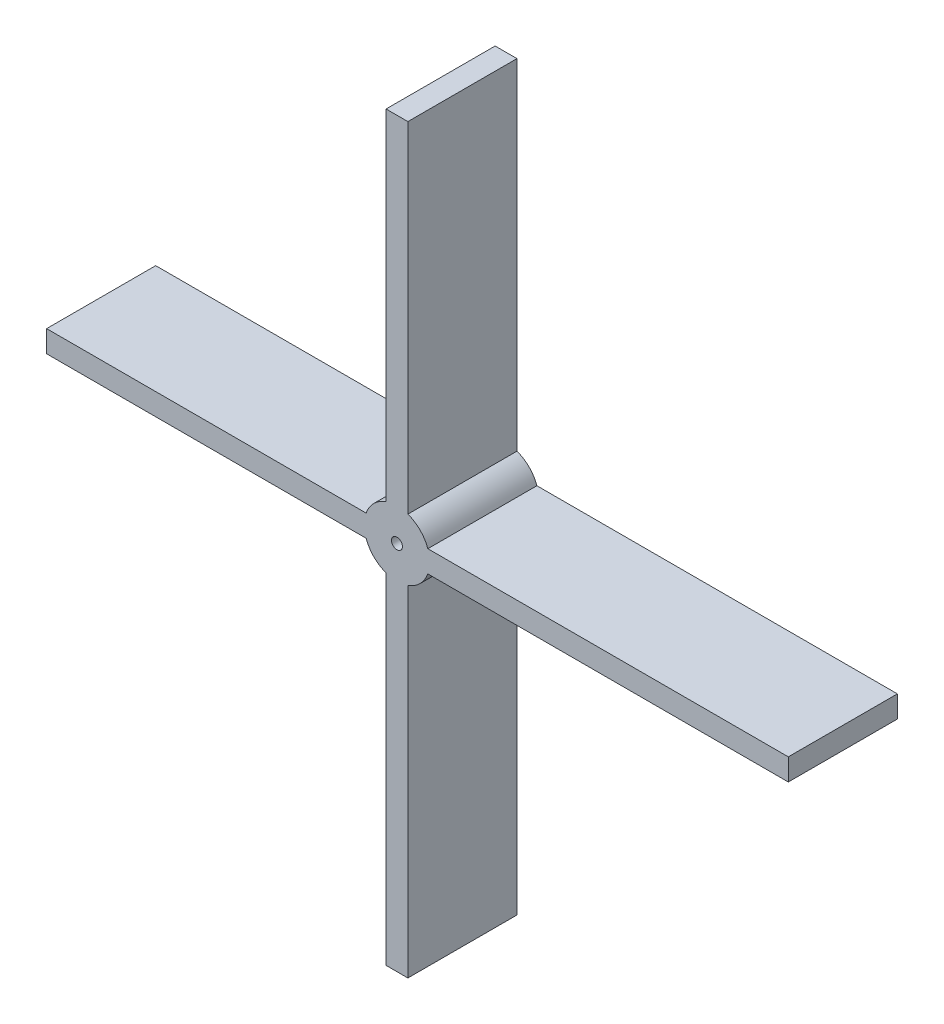
ISO-10303-21;
HEADER;
FILE_DESCRIPTION(('STEP AP214'),'2;1');
FILE_NAME('part.step','',(''),(''),'','','');
FILE_SCHEMA(('AUTOMOTIVE_DESIGN { 1 0 10303 214 1 1 1 1 }'));
ENDSEC;
DATA;
#1=APPLICATION_CONTEXT('core data for automotive mechanical design processes');
#2=APPLICATION_PROTOCOL_DEFINITION('international standard','automotive_design',2000,#1);
#3=PRODUCT_CONTEXT('',#1,'mechanical');
#4=PRODUCT('Part','Part','',(#3));
#5=PRODUCT_RELATED_PRODUCT_CATEGORY('part','',(#4));
#6=PRODUCT_DEFINITION_FORMATION('','',#4);
#7=PRODUCT_DEFINITION_CONTEXT('part definition',#1,'design');
#8=PRODUCT_DEFINITION('design','',#6,#7);
#9=PRODUCT_DEFINITION_SHAPE('','',#8);
#10=(LENGTH_UNIT() NAMED_UNIT(*) SI_UNIT(.MILLI.,.METRE.));
#11=(NAMED_UNIT(*) PLANE_ANGLE_UNIT() SI_UNIT($,.RADIAN.));
#12=(NAMED_UNIT(*) SI_UNIT($,.STERADIAN.) SOLID_ANGLE_UNIT());
#13=UNCERTAINTY_MEASURE_WITH_UNIT(LENGTH_MEASURE(1.E-05),#10,'distance_accuracy_value','');
#14=(GEOMETRIC_REPRESENTATION_CONTEXT(3) GLOBAL_UNCERTAINTY_ASSIGNED_CONTEXT((#13)) GLOBAL_UNIT_ASSIGNED_CONTEXT((#10,
#11,#12)) REPRESENTATION_CONTEXT('',''));
#15=CARTESIAN_POINT('',(0.,0.,0.));
#16=DIRECTION('',(0.,0.,1.));
#17=DIRECTION('',(1.,0.,0.));
#18=AXIS2_PLACEMENT_3D('',#15,#16,#17);
#19=CARTESIAN_POINT('',(5.,-5.,50.));
#20=DIRECTION('',(0.,1.,0.));
#21=DIRECTION('',(-1.,0.,0.));
#22=AXIS2_PLACEMENT_3D('',#19,#20,#21);
#23=PLANE('',#22);
#24=DIRECTION('',(1.,0.,0.));
#25=VECTOR('',#24,1.);
#26=CARTESIAN_POINT('',(5.,-5.,50.));
#27=LINE('',#26,#25);
#28=CARTESIAN_POINT('',(14.142135623731,-5.,50.));
#29=VERTEX_POINT('',#28);
#30=CARTESIAN_POINT('',(179.394262613274,-5.,50.));
#31=VERTEX_POINT('',#30);
#32=EDGE_CURVE('E239',#29,#31,#27,.T.);
#33=ORIENTED_EDGE('',*,*,#32,.F.);
#34=DIRECTION('',(0.,0.,-1.));
#35=VECTOR('',#34,1.);
#36=CARTESIAN_POINT('',(14.1421356237309,-5.,92.4264068711929));
#37=LINE('',#36,#35);
#38=CARTESIAN_POINT('',(14.142135623731,-5.,0.));
#39=VERTEX_POINT('',#38);
#40=EDGE_CURVE('E204',#29,#39,#37,.T.);
#41=ORIENTED_EDGE('',*,*,#40,.T.);
#42=DIRECTION('',(1.,0.,0.));
#43=VECTOR('',#42,1.);
#44=CARTESIAN_POINT('',(5.,-5.,0.));
#45=LINE('',#44,#43);
#46=CARTESIAN_POINT('',(179.394262613274,-5.,0.));
#47=VERTEX_POINT('',#46);
#48=EDGE_CURVE('E200',#39,#47,#45,.T.);
#49=ORIENTED_EDGE('',*,*,#48,.T.);
#50=DIRECTION('',(0.,0.,-1.));
#51=VECTOR('',#50,1.);
#52=CARTESIAN_POINT('',(179.394262613274,-5.,50.));
#53=LINE('',#52,#51);
#54=EDGE_CURVE('E11',#31,#47,#53,.T.);
#55=ORIENTED_EDGE('',*,*,#54,.F.);
#56=EDGE_LOOP('',(#33,#41,#49,#55));
#57=FACE_BOUND('',#56,.T.);
#58=ADVANCED_FACE('F45',(#57),#23,.F.);
#59=CARTESIAN_POINT('',(179.394262613274,5.,50.));
#60=DIRECTION('',(-1.,0.,0.));
#61=DIRECTION('',(0.,0.,1.));
#62=AXIS2_PLACEMENT_3D('',#59,#60,#61);
#63=PLANE('',#62);
#64=DIRECTION('',(0.,1.,0.));
#65=VECTOR('',#64,1.);
#66=CARTESIAN_POINT('',(179.394262613274,5.,0.));
#67=LINE('',#66,#65);
#68=CARTESIAN_POINT('',(179.394262613274,5.,0.));
#69=VERTEX_POINT('',#68);
#70=EDGE_CURVE('E203',#47,#69,#67,.T.);
#71=ORIENTED_EDGE('',*,*,#70,.T.);
#72=DIRECTION('',(0.,0.,-1.));
#73=VECTOR('',#72,1.);
#74=CARTESIAN_POINT('',(179.394262613274,5.,50.));
#75=LINE('',#74,#73);
#76=CARTESIAN_POINT('',(179.394262613274,5.,50.));
#77=VERTEX_POINT('',#76);
#78=EDGE_CURVE('E53',#77,#69,#75,.T.);
#79=ORIENTED_EDGE('',*,*,#78,.F.);
#80=DIRECTION('',(0.,1.,0.));
#81=VECTOR('',#80,1.);
#82=CARTESIAN_POINT('',(179.394262613274,5.,50.));
#83=LINE('',#82,#81);
#84=EDGE_CURVE('E320',#31,#77,#83,.T.);
#85=ORIENTED_EDGE('',*,*,#84,.F.);
#86=ORIENTED_EDGE('',*,*,#54,.T.);
#87=EDGE_LOOP('',(#71,#79,#85,#86));
#88=FACE_BOUND('',#87,.T.);
#89=ADVANCED_FACE('F371',(#88),#63,.F.);
#90=CARTESIAN_POINT('',(5.,5.,50.));
#91=DIRECTION('',(0.,-1.,0.));
#92=DIRECTION('',(0.,0.,-1.));
#93=AXIS2_PLACEMENT_3D('',#90,#91,#92);
#94=PLANE('',#93);
#95=DIRECTION('',(-1.,0.,0.));
#96=VECTOR('',#95,1.);
#97=CARTESIAN_POINT('',(5.,5.,0.));
#98=LINE('',#97,#96);
#99=CARTESIAN_POINT('',(14.1421356237309,5.,0.));
#100=VERTEX_POINT('',#99);
#101=EDGE_CURVE('E207',#69,#100,#98,.T.);
#102=ORIENTED_EDGE('',*,*,#101,.T.);
#103=DIRECTION('',(0.,0.,-1.));
#104=VECTOR('',#103,1.);
#105=CARTESIAN_POINT('',(14.1421356237309,5.,92.4264068711929));
#106=LINE('',#105,#104);
#107=CARTESIAN_POINT('',(14.1421356237309,5.,50.));
#108=VERTEX_POINT('',#107);
#109=EDGE_CURVE('E312',#100,#108,#106,.F.);
#110=ORIENTED_EDGE('',*,*,#109,.T.);
#111=DIRECTION('',(-1.,0.,0.));
#112=VECTOR('',#111,1.);
#113=CARTESIAN_POINT('',(5.,5.,50.));
#114=LINE('',#113,#112);
#115=EDGE_CURVE('E270',#77,#108,#114,.T.);
#116=ORIENTED_EDGE('',*,*,#115,.F.);
#117=ORIENTED_EDGE('',*,*,#78,.T.);
#118=EDGE_LOOP('',(#102,#110,#116,#117));
#119=FACE_BOUND('',#118,.T.);
#120=ADVANCED_FACE('F267',(#119),#94,.F.);
#121=CARTESIAN_POINT('',(4.99999999999998,170.,50.));
#122=DIRECTION('',(-1.,0.,0.));
#123=DIRECTION('',(0.,-1.,0.));
#124=AXIS2_PLACEMENT_3D('',#121,#122,#123);
#125=PLANE('',#124);
#126=DIRECTION('',(0.,1.,0.));
#127=VECTOR('',#126,1.);
#128=CARTESIAN_POINT('',(4.99999999999998,170.,50.));
#129=LINE('',#128,#127);
#130=CARTESIAN_POINT('',(5.,14.142135623731,50.));
#131=VERTEX_POINT('',#130);
#132=CARTESIAN_POINT('',(4.99999999999998,170.,50.));
#133=VERTEX_POINT('',#132);
#134=EDGE_CURVE('E325',#131,#133,#129,.T.);
#135=ORIENTED_EDGE('',*,*,#134,.F.);
#136=DIRECTION('',(0.,0.,-1.));
#137=VECTOR('',#136,1.);
#138=CARTESIAN_POINT('',(5.,14.1421356237309,92.4264068711929));
#139=LINE('',#138,#137);
#140=CARTESIAN_POINT('',(5.,14.142135623731,0.));
#141=VERTEX_POINT('',#140);
#142=EDGE_CURVE('E309',#131,#141,#139,.T.);
#143=ORIENTED_EDGE('',*,*,#142,.T.);
#144=DIRECTION('',(0.,1.,0.));
#145=VECTOR('',#144,1.);
#146=CARTESIAN_POINT('',(4.99999999999998,170.,0.));
#147=LINE('',#146,#145);
#148=CARTESIAN_POINT('',(4.99999999999998,170.,0.));
#149=VERTEX_POINT('',#148);
#150=EDGE_CURVE('E211',#141,#149,#147,.T.);
#151=ORIENTED_EDGE('',*,*,#150,.T.);
#152=DIRECTION('',(0.,0.,-1.));
#153=VECTOR('',#152,1.);
#154=CARTESIAN_POINT('',(4.99999999999998,170.,50.));
#155=LINE('',#154,#153);
#156=EDGE_CURVE('E258',#133,#149,#155,.T.);
#157=ORIENTED_EDGE('',*,*,#156,.F.);
#158=EDGE_LOOP('',(#135,#143,#151,#157));
#159=FACE_BOUND('',#158,.T.);
#160=ADVANCED_FACE('F390',(#159),#125,.F.);
#161=CARTESIAN_POINT('',(-5.,170.,50.));
#162=DIRECTION('',(0.,-1.,0.));
#163=DIRECTION('',(0.,0.,-1.));
#164=AXIS2_PLACEMENT_3D('',#161,#162,#163);
#165=PLANE('',#164);
#166=DIRECTION('',(-1.,0.,0.));
#167=VECTOR('',#166,1.);
#168=CARTESIAN_POINT('',(-5.,170.,0.));
#169=LINE('',#168,#167);
#170=CARTESIAN_POINT('',(-5.,170.,0.));
#171=VERTEX_POINT('',#170);
#172=EDGE_CURVE('E214',#149,#171,#169,.T.);
#173=ORIENTED_EDGE('',*,*,#172,.T.);
#174=DIRECTION('',(0.,0.,-1.));
#175=VECTOR('',#174,1.);
#176=CARTESIAN_POINT('',(-5.,170.,50.));
#177=LINE('',#176,#175);
#178=CARTESIAN_POINT('',(-5.,170.,50.));
#179=VERTEX_POINT('',#178);
#180=EDGE_CURVE('E254',#179,#171,#177,.T.);
#181=ORIENTED_EDGE('',*,*,#180,.F.);
#182=DIRECTION('',(-1.,0.,0.));
#183=VECTOR('',#182,1.);
#184=CARTESIAN_POINT('',(-5.,170.,50.));
#185=LINE('',#184,#183);
#186=EDGE_CURVE('E328',#133,#179,#185,.T.);
#187=ORIENTED_EDGE('',*,*,#186,.F.);
#188=ORIENTED_EDGE('',*,*,#156,.T.);
#189=EDGE_LOOP('',(#173,#181,#187,#188));
#190=FACE_BOUND('',#189,.T.);
#191=ADVANCED_FACE('F394',(#190),#165,.F.);
#192=CARTESIAN_POINT('',(-5.,170.,50.));
#193=DIRECTION('',(1.,0.,0.));
#194=DIRECTION('',(0.,1.,0.));
#195=AXIS2_PLACEMENT_3D('',#192,#193,#194);
#196=PLANE('',#195);
#197=DIRECTION('',(0.,-1.,0.));
#198=VECTOR('',#197,1.);
#199=CARTESIAN_POINT('',(-5.,170.,0.));
#200=LINE('',#199,#198);
#201=CARTESIAN_POINT('',(-4.99999999999998,14.142135623731,0.));
#202=VERTEX_POINT('',#201);
#203=EDGE_CURVE('E217',#171,#202,#200,.T.);
#204=ORIENTED_EDGE('',*,*,#203,.T.);
#205=DIRECTION('',(0.,0.,-1.));
#206=VECTOR('',#205,1.);
#207=CARTESIAN_POINT('',(-4.99999999999998,14.142135623731,92.4264068711929));
#208=LINE('',#207,#206);
#209=CARTESIAN_POINT('',(-4.99999999999998,14.142135623731,50.));
#210=VERTEX_POINT('',#209);
#211=EDGE_CURVE('E305',#202,#210,#208,.F.);
#212=ORIENTED_EDGE('',*,*,#211,.T.);
#213=DIRECTION('',(0.,-1.,0.));
#214=VECTOR('',#213,1.);
#215=CARTESIAN_POINT('',(-5.,170.,50.));
#216=LINE('',#215,#214);
#217=EDGE_CURVE('E331',#179,#210,#216,.T.);
#218=ORIENTED_EDGE('',*,*,#217,.F.);
#219=ORIENTED_EDGE('',*,*,#180,.T.);
#220=EDGE_LOOP('',(#204,#212,#218,#219));
#221=FACE_BOUND('',#220,.T.);
#222=ADVANCED_FACE('F397',(#221),#196,.F.);
#223=CARTESIAN_POINT('',(-160.605737386726,5.,50.));
#224=DIRECTION('',(0.,-1.,0.));
#225=DIRECTION('',(0.,0.,-1.));
#226=AXIS2_PLACEMENT_3D('',#223,#224,#225);
#227=PLANE('',#226);
#228=DIRECTION('',(-1.,0.,0.));
#229=VECTOR('',#228,1.);
#230=CARTESIAN_POINT('',(-160.605737386726,5.,50.));
#231=LINE('',#230,#229);
#232=CARTESIAN_POINT('',(-14.1421356237309,5.,50.));
#233=VERTEX_POINT('',#232);
#234=CARTESIAN_POINT('',(-160.605737386726,5.,50.));
#235=VERTEX_POINT('',#234);
#236=EDGE_CURVE('E189',#233,#235,#231,.T.);
#237=ORIENTED_EDGE('',*,*,#236,.F.);
#238=DIRECTION('',(0.,0.,-1.));
#239=VECTOR('',#238,1.);
#240=CARTESIAN_POINT('',(-14.1421356237309,5.,92.4264068711929));
#241=LINE('',#240,#239);
#242=CARTESIAN_POINT('',(-14.1421356237309,5.,0.));
#243=VERTEX_POINT('',#242);
#244=EDGE_CURVE('E175',#233,#243,#241,.T.);
#245=ORIENTED_EDGE('',*,*,#244,.T.);
#246=DIRECTION('',(-1.,0.,0.));
#247=VECTOR('',#246,1.);
#248=CARTESIAN_POINT('',(-160.605737386726,5.,0.));
#249=LINE('',#248,#247);
#250=CARTESIAN_POINT('',(-160.605737386726,5.,0.));
#251=VERTEX_POINT('',#250);
#252=EDGE_CURVE('E221',#243,#251,#249,.T.);
#253=ORIENTED_EDGE('',*,*,#252,.T.);
#254=DIRECTION('',(0.,0.,-1.));
#255=VECTOR('',#254,1.);
#256=CARTESIAN_POINT('',(-160.605737386726,5.,50.));
#257=LINE('',#256,#255);
#258=EDGE_CURVE('E250',#235,#251,#257,.T.);
#259=ORIENTED_EDGE('',*,*,#258,.F.);
#260=EDGE_LOOP('',(#237,#245,#253,#259));
#261=FACE_BOUND('',#260,.T.);
#262=ADVANCED_FACE('F337',(#261),#227,.F.);
#263=CARTESIAN_POINT('',(-160.605737386726,5.,50.));
#264=DIRECTION('',(1.,0.,0.));
#265=DIRECTION('',(0.,0.,-1.));
#266=AXIS2_PLACEMENT_3D('',#263,#264,#265);
#267=PLANE('',#266);
#268=DIRECTION('',(0.,-1.,0.));
#269=VECTOR('',#268,1.);
#270=CARTESIAN_POINT('',(-160.605737386726,5.,0.));
#271=LINE('',#270,#269);
#272=CARTESIAN_POINT('',(-160.605737386726,-5.,0.));
#273=VERTEX_POINT('',#272);
#274=EDGE_CURVE('E224',#251,#273,#271,.T.);
#275=ORIENTED_EDGE('',*,*,#274,.T.);
#276=DIRECTION('',(0.,0.,-1.));
#277=VECTOR('',#276,1.);
#278=CARTESIAN_POINT('',(-160.605737386726,-5.,50.));
#279=LINE('',#278,#277);
#280=CARTESIAN_POINT('',(-160.605737386726,-5.,50.));
#281=VERTEX_POINT('',#280);
#282=EDGE_CURVE('E247',#281,#273,#279,.T.);
#283=ORIENTED_EDGE('',*,*,#282,.F.);
#284=DIRECTION('',(0.,-1.,0.));
#285=VECTOR('',#284,1.);
#286=CARTESIAN_POINT('',(-160.605737386726,5.,50.));
#287=LINE('',#286,#285);
#288=EDGE_CURVE('E180',#235,#281,#287,.T.);
#289=ORIENTED_EDGE('',*,*,#288,.F.);
#290=ORIENTED_EDGE('',*,*,#258,.T.);
#291=EDGE_LOOP('',(#275,#283,#289,#290));
#292=FACE_BOUND('',#291,.T.);
#293=ADVANCED_FACE('F341',(#292),#267,.F.);
#294=CARTESIAN_POINT('',(-160.605737386726,-5.,50.));
#295=DIRECTION('',(0.,1.,0.));
#296=DIRECTION('',(0.,0.,1.));
#297=AXIS2_PLACEMENT_3D('',#294,#295,#296);
#298=PLANE('',#297);
#299=DIRECTION('',(1.,0.,0.));
#300=VECTOR('',#299,1.);
#301=CARTESIAN_POINT('',(-160.605737386726,-5.,0.));
#302=LINE('',#301,#300);
#303=CARTESIAN_POINT('',(-14.142135623731,-5.,0.));
#304=VERTEX_POINT('',#303);
#305=EDGE_CURVE('E173',#273,#304,#302,.T.);
#306=ORIENTED_EDGE('',*,*,#305,.T.);
#307=DIRECTION('',(0.,0.,-1.));
#308=VECTOR('',#307,1.);
#309=CARTESIAN_POINT('',(-14.1421356237309,-5.,92.4264068711929));
#310=LINE('',#309,#308);
#311=CARTESIAN_POINT('',(-14.142135623731,-5.,50.));
#312=VERTEX_POINT('',#311);
#313=EDGE_CURVE('E157',#304,#312,#310,.F.);
#314=ORIENTED_EDGE('',*,*,#313,.T.);
#315=DIRECTION('',(1.,0.,0.));
#316=VECTOR('',#315,1.);
#317=CARTESIAN_POINT('',(-160.605737386726,-5.,50.));
#318=LINE('',#317,#316);
#319=EDGE_CURVE('E171',#281,#312,#318,.T.);
#320=ORIENTED_EDGE('',*,*,#319,.F.);
#321=ORIENTED_EDGE('',*,*,#282,.T.);
#322=EDGE_LOOP('',(#306,#314,#320,#321));
#323=FACE_BOUND('',#322,.T.);
#324=ADVANCED_FACE('F169',(#323),#298,.F.);
#325=CARTESIAN_POINT('',(-5.,-5.,50.));
#326=DIRECTION('',(1.,0.,0.));
#327=DIRECTION('',(0.,1.,0.));
#328=AXIS2_PLACEMENT_3D('',#325,#326,#327);
#329=PLANE('',#328);
#330=DIRECTION('',(0.,-1.,0.));
#331=VECTOR('',#330,1.);
#332=CARTESIAN_POINT('',(-5.,-5.,50.));
#333=LINE('',#332,#331);
#334=CARTESIAN_POINT('',(-5.,-14.142135623731,50.));
#335=VERTEX_POINT('',#334);
#336=CARTESIAN_POINT('',(-4.99999999999998,-170.,50.));
#337=VERTEX_POINT('',#336);
#338=EDGE_CURVE('E183',#335,#337,#333,.T.);
#339=ORIENTED_EDGE('',*,*,#338,.F.);
#340=DIRECTION('',(0.,0.,-1.));
#341=VECTOR('',#340,1.);
#342=CARTESIAN_POINT('',(-5.,-14.1421356237309,92.4264068711929));
#343=LINE('',#342,#341);
#344=CARTESIAN_POINT('',(-5.,-14.142135623731,0.));
#345=VERTEX_POINT('',#344);
#346=EDGE_CURVE('E160',#335,#345,#343,.T.);
#347=ORIENTED_EDGE('',*,*,#346,.T.);
#348=DIRECTION('',(0.,-1.,0.));
#349=VECTOR('',#348,1.);
#350=CARTESIAN_POINT('',(-5.,-5.,0.));
#351=LINE('',#350,#349);
#352=CARTESIAN_POINT('',(-4.99999999999998,-170.,0.));
#353=VERTEX_POINT('',#352);
#354=EDGE_CURVE('E229',#345,#353,#351,.T.);
#355=ORIENTED_EDGE('',*,*,#354,.T.);
#356=DIRECTION('',(0.,0.,-1.));
#357=VECTOR('',#356,1.);
#358=CARTESIAN_POINT('',(-4.99999999999998,-170.,50.));
#359=LINE('',#358,#357);
#360=EDGE_CURVE('E243',#337,#353,#359,.T.);
#361=ORIENTED_EDGE('',*,*,#360,.F.);
#362=EDGE_LOOP('',(#339,#347,#355,#361));
#363=FACE_BOUND('',#362,.T.);
#364=ADVANCED_FACE('F455',(#363),#329,.F.);
#365=CARTESIAN_POINT('',(-4.99999999999998,-170.,50.));
#366=DIRECTION('',(0.,1.,0.));
#367=DIRECTION('',(0.,0.,1.));
#368=AXIS2_PLACEMENT_3D('',#365,#366,#367);
#369=PLANE('',#368);
#370=DIRECTION('',(1.,0.,0.));
#371=VECTOR('',#370,1.);
#372=CARTESIAN_POINT('',(-4.99999999999998,-170.,0.));
#373=LINE('',#372,#371);
#374=CARTESIAN_POINT('',(5.00000000000002,-170.,0.));
#375=VERTEX_POINT('',#374);
#376=EDGE_CURVE('E232',#353,#375,#373,.T.);
#377=ORIENTED_EDGE('',*,*,#376,.T.);
#378=DIRECTION('',(0.,0.,-1.));
#379=VECTOR('',#378,1.);
#380=CARTESIAN_POINT('',(5.00000000000002,-170.,50.));
#381=LINE('',#380,#379);
#382=CARTESIAN_POINT('',(5.00000000000002,-170.,50.));
#383=VERTEX_POINT('',#382);
#384=EDGE_CURVE('E199',#383,#375,#381,.T.);
#385=ORIENTED_EDGE('',*,*,#384,.F.);
#386=DIRECTION('',(1.,0.,0.));
#387=VECTOR('',#386,1.);
#388=CARTESIAN_POINT('',(-4.99999999999998,-170.,50.));
#389=LINE('',#388,#387);
#390=EDGE_CURVE('E187',#337,#383,#389,.T.);
#391=ORIENTED_EDGE('',*,*,#390,.F.);
#392=ORIENTED_EDGE('',*,*,#360,.T.);
#393=EDGE_LOOP('',(#377,#385,#391,#392));
#394=FACE_BOUND('',#393,.T.);
#395=ADVANCED_FACE('F366',(#394),#369,.F.);
#396=CARTESIAN_POINT('',(5.,-5.,50.));
#397=DIRECTION('',(-1.,0.,0.));
#398=DIRECTION('',(0.,-1.,0.));
#399=AXIS2_PLACEMENT_3D('',#396,#397,#398);
#400=PLANE('',#399);
#401=DIRECTION('',(0.,1.,0.));
#402=VECTOR('',#401,1.);
#403=CARTESIAN_POINT('',(5.,-5.,0.));
#404=LINE('',#403,#402);
#405=CARTESIAN_POINT('',(5.,-14.142135623731,0.));
#406=VERTEX_POINT('',#405);
#407=EDGE_CURVE('E235',#375,#406,#404,.T.);
#408=ORIENTED_EDGE('',*,*,#407,.T.);
#409=DIRECTION('',(0.,0.,-1.));
#410=VECTOR('',#409,1.);
#411=CARTESIAN_POINT('',(5.,-14.142135623731,92.4264068711929));
#412=LINE('',#411,#410);
#413=CARTESIAN_POINT('',(5.,-14.142135623731,50.));
#414=VERTEX_POINT('',#413);
#415=EDGE_CURVE('E163',#406,#414,#412,.F.);
#416=ORIENTED_EDGE('',*,*,#415,.T.);
#417=DIRECTION('',(0.,1.,0.));
#418=VECTOR('',#417,1.);
#419=CARTESIAN_POINT('',(5.,-5.,50.));
#420=LINE('',#419,#418);
#421=EDGE_CURVE('E195',#383,#414,#420,.T.);
#422=ORIENTED_EDGE('',*,*,#421,.F.);
#423=ORIENTED_EDGE('',*,*,#384,.T.);
#424=EDGE_LOOP('',(#408,#416,#422,#423));
#425=FACE_BOUND('',#424,.T.);
#426=ADVANCED_FACE('F357',(#425),#400,.F.);
#427=CARTESIAN_POINT('',(0.,0.,50.));
#428=DIRECTION('',(0.,0.,-1.));
#429=DIRECTION('',(-1.,0.,0.));
#430=AXIS2_PLACEMENT_3D('',#427,#428,#429);
#431=PLANE('',#430);
#432=CARTESIAN_POINT('',(0.,0.,50.));
#433=DIRECTION('',(0.,0.,1.));
#434=DIRECTION('',(1.,0.,0.));
#435=AXIS2_PLACEMENT_3D('',#432,#433,#434);
#436=CIRCLE('',#435,2.5);
#437=CARTESIAN_POINT('',(2.5,0.,50.));
#438=VERTEX_POINT('',#437);
#439=EDGE_CURVE('E347',#438,#438,#436,.T.);
#440=ORIENTED_EDGE('',*,*,#439,.F.);
#441=EDGE_LOOP('',(#440));
#442=FACE_BOUND('',#441,.T.);
#443=CARTESIAN_POINT('',(0.,0.,50.));
#444=DIRECTION('',(0.,0.,-1.));
#445=DIRECTION('',(-1.,0.,0.));
#446=AXIS2_PLACEMENT_3D('',#443,#444,#445);
#447=CIRCLE('',#446,15.);
#448=EDGE_CURVE('E164',#414,#29,#447,.F.);
#449=ORIENTED_EDGE('',*,*,#448,.T.);
#450=ORIENTED_EDGE('',*,*,#32,.T.);
#451=ORIENTED_EDGE('',*,*,#84,.T.);
#452=ORIENTED_EDGE('',*,*,#115,.T.);
#453=EDGE_CURVE('E383',#108,#131,#447,.F.);
#454=ORIENTED_EDGE('',*,*,#453,.T.);
#455=ORIENTED_EDGE('',*,*,#134,.T.);
#456=ORIENTED_EDGE('',*,*,#186,.T.);
#457=ORIENTED_EDGE('',*,*,#217,.T.);
#458=EDGE_CURVE('E67',#210,#233,#447,.F.);
#459=ORIENTED_EDGE('',*,*,#458,.T.);
#460=ORIENTED_EDGE('',*,*,#236,.T.);
#461=ORIENTED_EDGE('',*,*,#288,.T.);
#462=ORIENTED_EDGE('',*,*,#319,.T.);
#463=EDGE_CURVE('E60',#312,#335,#447,.F.);
#464=ORIENTED_EDGE('',*,*,#463,.T.);
#465=ORIENTED_EDGE('',*,*,#338,.T.);
#466=ORIENTED_EDGE('',*,*,#390,.T.);
#467=ORIENTED_EDGE('',*,*,#421,.T.);
#468=EDGE_LOOP('',(#449,#450,#451,#452,#454,#455,#456,#457,#459,#460,#461,#462,#464,#465,#466,#467));
#469=FACE_BOUND('',#468,.T.);
#470=ADVANCED_FACE('F178',(#442,#469),#431,.F.);
#471=CARTESIAN_POINT('',(0.,0.,0.));
#472=DIRECTION('',(0.,0.,-1.));
#473=DIRECTION('',(-1.,0.,0.));
#474=AXIS2_PLACEMENT_3D('',#471,#472,#473);
#475=PLANE('',#474);
#476=CARTESIAN_POINT('',(0.,0.,0.));
#477=DIRECTION('',(0.,0.,1.));
#478=DIRECTION('',(1.,0.,0.));
#479=AXIS2_PLACEMENT_3D('',#476,#477,#478);
#480=CIRCLE('',#479,2.49999999999999);
#481=CARTESIAN_POINT('',(2.49999999999999,0.,0.));
#482=VERTEX_POINT('',#481);
#483=EDGE_CURVE('E294',#482,#482,#480,.T.);
#484=ORIENTED_EDGE('',*,*,#483,.T.);
#485=EDGE_LOOP('',(#484));
#486=FACE_BOUND('',#485,.T.);
#487=ORIENTED_EDGE('',*,*,#48,.F.);
#488=CARTESIAN_POINT('',(0.,0.,0.));
#489=DIRECTION('',(0.,0.,-1.));
#490=DIRECTION('',(-1.,0.,0.));
#491=AXIS2_PLACEMENT_3D('',#488,#489,#490);
#492=CIRCLE('',#491,15.);
#493=EDGE_CURVE('E286',#39,#406,#492,.T.);
#494=ORIENTED_EDGE('',*,*,#493,.T.);
#495=ORIENTED_EDGE('',*,*,#407,.F.);
#496=ORIENTED_EDGE('',*,*,#376,.F.);
#497=ORIENTED_EDGE('',*,*,#354,.F.);
#498=EDGE_CURVE('E291',#345,#304,#492,.T.);
#499=ORIENTED_EDGE('',*,*,#498,.T.);
#500=ORIENTED_EDGE('',*,*,#305,.F.);
#501=ORIENTED_EDGE('',*,*,#274,.F.);
#502=ORIENTED_EDGE('',*,*,#252,.F.);
#503=EDGE_CURVE('E285',#243,#202,#492,.T.);
#504=ORIENTED_EDGE('',*,*,#503,.T.);
#505=ORIENTED_EDGE('',*,*,#203,.F.);
#506=ORIENTED_EDGE('',*,*,#172,.F.);
#507=ORIENTED_EDGE('',*,*,#150,.F.);
#508=EDGE_CURVE('E279',#141,#100,#492,.T.);
#509=ORIENTED_EDGE('',*,*,#508,.T.);
#510=ORIENTED_EDGE('',*,*,#101,.F.);
#511=ORIENTED_EDGE('',*,*,#70,.F.);
#512=EDGE_LOOP('',(#487,#494,#495,#496,#497,#499,#500,#501,#502,#504,#505,#506,#507,#509,#510,#511));
#513=FACE_BOUND('',#512,.T.);
#514=ADVANCED_FACE('F277',(#486,#513),#475,.T.);
#515=CARTESIAN_POINT('',(0.,0.,92.4264068711929));
#516=DIRECTION('',(0.,0.,-1.));
#517=DIRECTION('',(-1.,0.,0.));
#518=AXIS2_PLACEMENT_3D('',#515,#516,#517);
#519=CYLINDRICAL_SURFACE('',#518,15.);
#520=ORIENTED_EDGE('',*,*,#40,.F.);
#521=ORIENTED_EDGE('',*,*,#448,.F.);
#522=ORIENTED_EDGE('',*,*,#415,.F.);
#523=ORIENTED_EDGE('',*,*,#493,.F.);
#524=EDGE_LOOP('',(#520,#521,#522,#523));
#525=FACE_BOUND('',#524,.T.);
#526=ADVANCED_FACE('F363',(#525),#519,.T.);
#527=ORIENTED_EDGE('',*,*,#313,.F.);
#528=ORIENTED_EDGE('',*,*,#498,.F.);
#529=ORIENTED_EDGE('',*,*,#346,.F.);
#530=ORIENTED_EDGE('',*,*,#463,.F.);
#531=EDGE_LOOP('',(#527,#528,#529,#530));
#532=FACE_BOUND('',#531,.T.);
#533=ADVANCED_FACE('F156',(#532),#519,.T.);
#534=ORIENTED_EDGE('',*,*,#211,.F.);
#535=ORIENTED_EDGE('',*,*,#503,.F.);
#536=ORIENTED_EDGE('',*,*,#244,.F.);
#537=ORIENTED_EDGE('',*,*,#458,.F.);
#538=EDGE_LOOP('',(#534,#535,#536,#537));
#539=FACE_BOUND('',#538,.T.);
#540=ADVANCED_FACE('F400',(#539),#519,.T.);
#541=ORIENTED_EDGE('',*,*,#109,.F.);
#542=ORIENTED_EDGE('',*,*,#508,.F.);
#543=ORIENTED_EDGE('',*,*,#142,.F.);
#544=ORIENTED_EDGE('',*,*,#453,.F.);
#545=EDGE_LOOP('',(#541,#542,#543,#544));
#546=FACE_BOUND('',#545,.T.);
#547=ADVANCED_FACE('F388',(#546),#519,.T.);
#548=CARTESIAN_POINT('',(0.,0.,50.));
#549=DIRECTION('',(0.,0.,1.));
#550=DIRECTION('',(1.,0.,0.));
#551=AXIS2_PLACEMENT_3D('',#548,#549,#550);
#552=CYLINDRICAL_SURFACE('',#551,2.49999999999999);
#553=ORIENTED_EDGE('',*,*,#483,.F.);
#554=EDGE_LOOP('',(#553));
#555=FACE_BOUND('',#554,.T.);
#556=ORIENTED_EDGE('',*,*,#439,.T.);
#557=EDGE_LOOP('',(#556));
#558=FACE_BOUND('',#557,.T.);
#559=ADVANCED_FACE('F354',(#555,#558),#552,.F.);
#560=CLOSED_SHELL('',(#58,#89,#120,#160,#191,#222,#262,#293,#324,#364,#395,#426,#470,#514,#526,
#533,#540,#547,#559));
#561=MANIFOLD_SOLID_BREP('B2',#560);
#562=ADVANCED_BREP_SHAPE_REPRESENTATION('',(#18,#561),#14);
#563=SHAPE_DEFINITION_REPRESENTATION(#9,#562);
ENDSEC;
END-ISO-10303-21;
